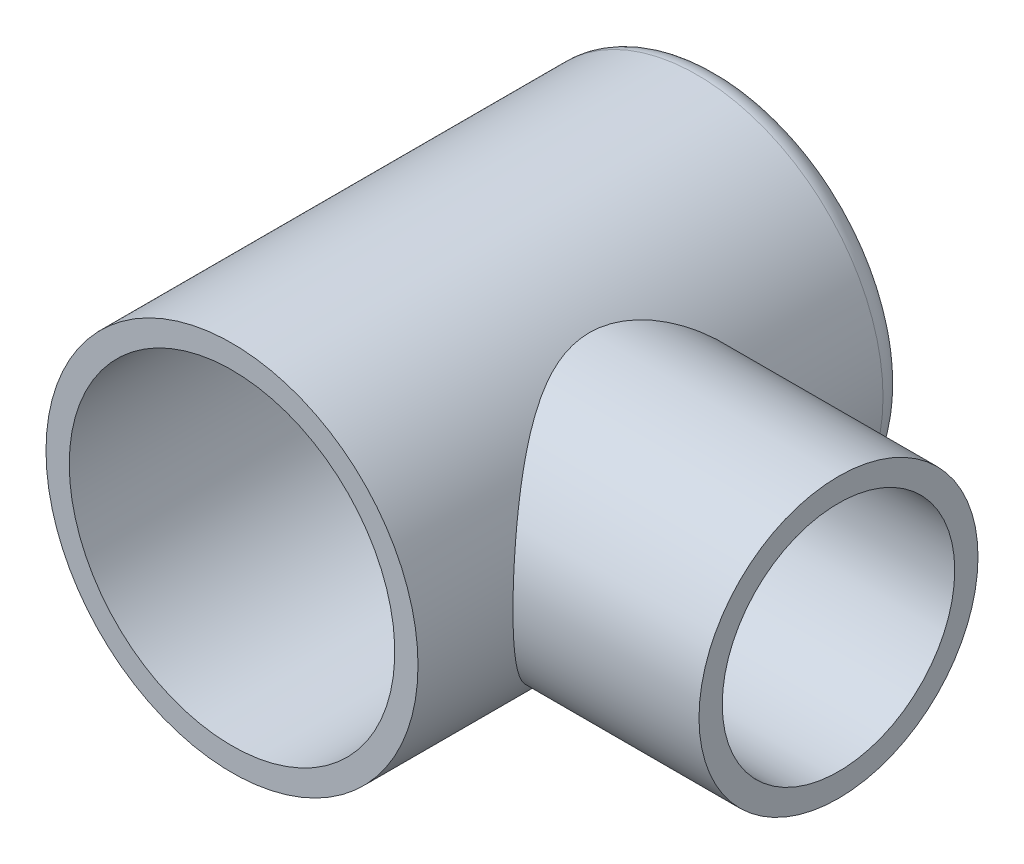
ISO-10303-21;
HEADER;
FILE_DESCRIPTION(('STEP AP214'),'2;1');
FILE_NAME('part.step','',(''),(''),'','','');
FILE_SCHEMA(('AUTOMOTIVE_DESIGN { 1 0 10303 214 1 1 1 1 }'));
ENDSEC;
DATA;
#1=APPLICATION_CONTEXT('core data for automotive mechanical design processes');
#2=APPLICATION_PROTOCOL_DEFINITION('international standard','automotive_design',2000,#1);
#3=PRODUCT_CONTEXT('',#1,'mechanical');
#4=PRODUCT('Part','Part','',(#3));
#5=PRODUCT_RELATED_PRODUCT_CATEGORY('part','',(#4));
#6=PRODUCT_DEFINITION_FORMATION('','',#4);
#7=PRODUCT_DEFINITION_CONTEXT('part definition',#1,'design');
#8=PRODUCT_DEFINITION('design','',#6,#7);
#9=PRODUCT_DEFINITION_SHAPE('','',#8);
#10=(LENGTH_UNIT() NAMED_UNIT(*) SI_UNIT(.MILLI.,.METRE.));
#11=(NAMED_UNIT(*) PLANE_ANGLE_UNIT() SI_UNIT($,.RADIAN.));
#12=(NAMED_UNIT(*) SI_UNIT($,.STERADIAN.) SOLID_ANGLE_UNIT());
#13=UNCERTAINTY_MEASURE_WITH_UNIT(LENGTH_MEASURE(1.E-05),#10,'distance_accuracy_value','');
#14=(GEOMETRIC_REPRESENTATION_CONTEXT(3) GLOBAL_UNCERTAINTY_ASSIGNED_CONTEXT((#13)) GLOBAL_UNIT_ASSIGNED_CONTEXT((#10,
#11,#12)) REPRESENTATION_CONTEXT('',''));
#15=CARTESIAN_POINT('',(0.,0.,0.));
#16=DIRECTION('',(0.,0.,1.));
#17=DIRECTION('',(1.,0.,0.));
#18=AXIS2_PLACEMENT_3D('',#15,#16,#17);
#19=CARTESIAN_POINT('',(0.,0.,7.99999999999996));
#20=DIRECTION('',(0.,0.,-0.999999999999997));
#21=DIRECTION('',(0.999999999999998,0.,0.));
#22=AXIS2_PLACEMENT_3D('',#19,#20,#21);
#23=PLANE('',#22);
#24=CARTESIAN_POINT('',(0.,0.,7.99999999999996));
#25=DIRECTION('',(0.,0.,0.999999999999997));
#26=DIRECTION('',(0.999999999999998,0.,0.));
#27=AXIS2_PLACEMENT_3D('',#24,#25,#26);
#28=CIRCLE('',#27,4.);
#29=CARTESIAN_POINT('',(3.99999999999999,0.,7.99999999999996));
#30=VERTEX_POINT('',#29);
#31=EDGE_CURVE('E72',#30,#30,#28,.T.);
#32=ORIENTED_EDGE('',*,*,#31,.T.);
#33=EDGE_LOOP('',(#32));
#34=FACE_BOUND('',#33,.T.);
#35=CARTESIAN_POINT('',(0.,0.,7.99999999999996));
#36=DIRECTION('',(0.,0.,0.999999999999997));
#37=DIRECTION('',(0.999999999999998,0.,0.));
#38=AXIS2_PLACEMENT_3D('',#35,#36,#37);
#39=CIRCLE('',#38,3.5);
#40=CARTESIAN_POINT('',(-3.49999999999999,0.,7.99999999999996));
#41=VERTEX_POINT('',#40);
#42=EDGE_CURVE('E110',#41,#41,#39,.T.);
#43=ORIENTED_EDGE('',*,*,#42,.F.);
#44=EDGE_LOOP('',(#43));
#45=FACE_BOUND('',#44,.T.);
#46=ADVANCED_FACE('F52',(#34,#45),#23,.F.);
#47=CARTESIAN_POINT('',(0.,0.,-1.99999999999999));
#48=DIRECTION('',(0.,0.,0.999999999999997));
#49=DIRECTION('',(-0.999999999999998,0.,0.));
#50=AXIS2_PLACEMENT_3D('',#47,#48,#49);
#51=CYLINDRICAL_SURFACE('',#50,4.);
#52=CARTESIAN_POINT('',(0.,0.,-1.99999999999999));
#53=DIRECTION('',(0.,0.,-0.999999999999997));
#54=DIRECTION('',(-0.999999999999998,0.,0.));
#55=AXIS2_PLACEMENT_3D('',#52,#53,#54);
#56=CIRCLE('',#55,4.);
#57=CARTESIAN_POINT('',(-3.99999999999999,0.,-1.99999999999999));
#58=VERTEX_POINT('',#57);
#59=EDGE_CURVE('E12',#58,#58,#56,.F.);
#60=ORIENTED_EDGE('',*,*,#59,.T.);
#61=EDGE_LOOP('',(#60));
#62=FACE_BOUND('',#61,.T.);
#63=CARTESIAN_POINT('',(4.,0.,-0.0425688714254572));
#64=CARTESIAN_POINT('',(3.99999929901188,0.0732613677680283,-0.0425681294064803));
#65=CARTESIAN_POINT('',(3.99798060344642,0.146542351053629,-0.0398783644385965));
#66=CARTESIAN_POINT('',(3.98996245699389,0.292508538993506,-0.0291740112904681));
#67=CARTESIAN_POINT('',(3.98396062416369,0.365193360793218,-0.0211562369206617));
#68=CARTESIAN_POINT('',(3.96012745087107,0.581731406983923,0.0107670346027781));
#69=CARTESIAN_POINT('',(3.93646888013437,0.723892660392384,0.0425420865656261));
#70=CARTESIAN_POINT('',(3.87591490407891,0.998506639011303,0.124856336149788));
#71=CARTESIAN_POINT('',(3.83910000314071,1.13101263465653,0.175281476957425));
#72=CARTESIAN_POINT('',(3.75501017021524,1.38483526994093,0.292516495506071));
#73=CARTESIAN_POINT('',(3.70773829853535,1.50615516858413,0.359321580158051));
#74=CARTESIAN_POINT('',(3.60099357013528,1.74693213195157,0.513954853795169));
#75=CARTESIAN_POINT('',(3.54079623314279,1.86517631030519,0.603156979847882));
#76=CARTESIAN_POINT('',(3.41533027981217,2.0860644994078,0.796431624417548));
#77=CARTESIAN_POINT('',(3.35005390635212,2.18868391091458,0.900527101022297));
#78=CARTESIAN_POINT('',(3.24492237261661,2.33993228026195,1.07796647267913));
#79=CARTESIAN_POINT('',(3.2052891581058,2.39379458304144,1.14706124098399));
#80=CARTESIAN_POINT('',(3.12676887933752,2.49548358548256,1.29002025939881));
#81=CARTESIAN_POINT('',(3.0878820430606,2.54330846513548,1.36388593762559));
#82=CARTESIAN_POINT('',(3.01210562553027,2.63261178619331,1.51620292345476));
#83=CARTESIAN_POINT('',(2.9752136814322,2.67409784691839,1.59464856653704));
#84=CARTESIAN_POINT('',(2.90479339731391,2.75043132677141,1.75613817612349));
#85=CARTESIAN_POINT('',(2.87126451310281,2.78527982077503,1.83918139528845));
#86=CARTESIAN_POINT('',(2.7995453278082,2.85760090658949,2.03639340399828));
#87=CARTESIAN_POINT('',(2.76315561923757,2.89251037008408,2.15220090250915));
#88=CARTESIAN_POINT('',(2.70343128888206,2.94841656316142,2.39022819170868));
#89=CARTESIAN_POINT('',(2.6800667983994,2.96944514417499,2.51243260291126));
#90=CARTESIAN_POINT('',(2.65007535494332,2.99625559824299,2.7617931530463));
#91=CARTESIAN_POINT('',(2.6436005765876,3.00189887157292,2.88898390185791));
#92=CARTESIAN_POINT('',(2.64919059245027,2.99696449042943,3.14266179080359));
#93=CARTESIAN_POINT('',(2.66126203341493,2.9863810204854,3.26914866236951));
#94=CARTESIAN_POINT('',(2.69935247502785,2.95195473462658,3.50381363263411));
#95=CARTESIAN_POINT('',(2.72374314386008,2.92964971367057,3.61250381871037));
#96=CARTESIAN_POINT('',(2.78228385423356,2.87411343637384,3.82430893802284));
#97=CARTESIAN_POINT('',(2.81644327194565,2.84087167817736,3.92741840118848));
#98=CARTESIAN_POINT('',(2.91483538729993,2.74066127604792,4.18994387426193));
#99=CARTESIAN_POINT('',(2.9845129831659,2.6656029678939,4.34423195445816));
#100=CARTESIAN_POINT('',(3.13066596252173,2.49236046828095,4.63582418373421));
#101=CARTESIAN_POINT('',(3.20715757761233,2.39412008565051,4.77308580909009));
#102=CARTESIAN_POINT('',(3.36103344637552,2.17303208149636,5.0329379073251));
#103=CARTESIAN_POINT('',(3.43839173465929,2.04962751039984,5.15507234180676));
#104=CARTESIAN_POINT('',(3.58496075956505,1.78084504353985,5.37795842266656));
#105=CARTESIAN_POINT('',(3.65418696517002,1.63551010852546,5.47875096910327));
#106=CARTESIAN_POINT('',(3.76559452155695,1.3558041609579,5.63739272700083));
#107=CARTESIAN_POINT('',(3.81041541916803,1.2250797406269,5.699800317149));
#108=CARTESIAN_POINT('',(3.88745808807126,0.952704346148676,5.80588088935944));
#109=CARTESIAN_POINT('',(3.91968774910058,0.811060281155401,5.84956560494769));
#110=CARTESIAN_POINT('',(3.96891177371227,0.519352465945107,5.91593785497662));
#111=CARTESIAN_POINT('',(3.98581186314606,0.369242566477487,5.93849548883176));
#112=CARTESIAN_POINT('',(4.00231766947939,0.0664024759297814,5.96053032093898));
#113=CARTESIAN_POINT('',(4.0019306830649,-0.0863265824213237,5.96001725708008));
#114=CARTESIAN_POINT('',(3.98485095596869,-0.373608422358571,5.93720939801986));
#115=CARTESIAN_POINT('',(3.96980177630783,-0.508444611327586,5.91711008323224));
#116=CARTESIAN_POINT('',(3.92702635972252,-0.772221384992236,5.8594835401177));
#117=CARTESIAN_POINT('',(3.89929742534594,-0.901160708783228,5.82195260341432));
#118=CARTESIAN_POINT('',(3.83199678428177,-1.15483339082488,5.72965617690301));
#119=CARTESIAN_POINT('',(3.79204165281684,-1.27925770587446,5.67432918102459));
#120=CARTESIAN_POINT('',(3.70333906113673,-1.51703769337244,5.54908580236102));
#121=CARTESIAN_POINT('',(3.65459038471486,-1.63039183139361,5.47916740127574));
#122=CARTESIAN_POINT('',(3.54238575945113,-1.86302046499997,5.31386644696053));
#123=CARTESIAN_POINT('',(3.47783324855999,-1.98012231440925,5.21618133379497));
#124=CARTESIAN_POINT('',(3.34476768394493,-2.19745073328884,5.0054063229399));
#125=CARTESIAN_POINT('',(3.27624605925973,-2.29763880438282,4.89228231391132));
#126=CARTESIAN_POINT('',(3.16783641864784,-2.44323760962617,4.70060129823206));
#127=CARTESIAN_POINT('',(3.12757855224153,-2.49441207840987,4.62657327036884));
#128=CARTESIAN_POINT('',(3.04868523124073,-2.59024776181559,4.47360440644699));
#129=CARTESIAN_POINT('',(3.01005037642924,-2.63490658340165,4.39466178048908));
#130=CARTESIAN_POINT('',(2.89884735629487,-2.75840992843588,4.15084826038665));
#131=CARTESIAN_POINT('',(2.83062934493712,-2.8272286655462,3.97840925241466));
#132=CARTESIAN_POINT('',(2.74237306217228,-2.91232161832907,3.68658489432916));
#133=CARTESIAN_POINT('',(2.71391502535151,-2.9386220669607,3.57264428808324));
#134=CARTESIAN_POINT('',(2.67084233048458,-2.97782857114492,3.34002161200894));
#135=CARTESIAN_POINT('',(2.65619677881272,-2.99076452454843,3.22135074520145));
#136=CARTESIAN_POINT('',(2.64315167964507,-3.00230698654587,2.98177193351367));
#137=CARTESIAN_POINT('',(2.64483460597191,-3.00084075038308,2.86085571412007));
#138=CARTESIAN_POINT('',(2.66432917886907,-2.98353723231362,2.62131697889622));
#139=CARTESIAN_POINT('',(2.68216163855031,-2.96768140541027,2.50269762475402));
#140=CARTESIAN_POINT('',(2.73634639677126,-2.91787829237152,2.24560555298943));
#141=CARTESIAN_POINT('',(2.77589185811732,-2.88073715900693,2.10845189393397));
#142=CARTESIAN_POINT('',(2.8676615343469,-2.78938673066517,1.84434626686756));
#143=CARTESIAN_POINT('',(2.91991769887725,-2.73513432117033,1.71742109666254));
#144=CARTESIAN_POINT('',(3.01293440174583,-2.6316132245464,1.51415864873975));
#145=CARTESIAN_POINT('',(3.05189072454864,-2.58648316812388,1.43481627227926));
#146=CARTESIAN_POINT('',(3.13140535919094,-2.48962257782423,1.28111640504182));
#147=CARTESIAN_POINT('',(3.17196358545146,-2.43789239621906,1.206758648541));
#148=CARTESIAN_POINT('',(3.25347248479455,-2.32800429973169,1.06307566786413));
#149=CARTESIAN_POINT('',(3.29442346245138,-2.26984095281447,0.993754779813766));
#150=CARTESIAN_POINT('',(3.3756032435117,-2.14725580217517,0.860410953708237));
#151=CARTESIAN_POINT('',(3.41583201121155,-2.08283369004462,0.796388277017199));
#152=CARTESIAN_POINT('',(3.49489651383713,-1.94728190281496,0.673457795497292));
#153=CARTESIAN_POINT('',(3.53371751668994,-1.87609990910415,0.61459804721401));
#154=CARTESIAN_POINT('',(3.60860502556332,-1.72767987087953,0.503101371511844));
#155=CARTESIAN_POINT('',(3.64467210969302,-1.65044310433565,0.450463136779797));
#156=CARTESIAN_POINT('',(3.71302541445825,-1.49030317410492,0.352089186519774));
#157=CARTESIAN_POINT('',(3.74531815238001,-1.40741018139534,0.306341532142554));
#158=CARTESIAN_POINT('',(3.8052164046783,-1.23634243548294,0.222374412531198));
#159=CARTESIAN_POINT('',(3.8328243370667,-1.14817043896907,0.184151062068023));
#160=CARTESIAN_POINT('',(3.89270294176924,-0.929739140257544,0.101868429607504));
#161=CARTESIAN_POINT('',(3.92219862865417,-0.797123031202015,0.0619067657569259));
#162=CARTESIAN_POINT('',(3.96768259876897,-0.525667463530594,0.000586248985263055));
#163=CARTESIAN_POINT('',(3.9837086019408,-0.386846538130216,-0.0208245582138599));
#164=CARTESIAN_POINT('',(3.994909382017,-0.205928000583096,-0.0357781700489366));
#165=CARTESIAN_POINT('',(3.99681576437034,-0.164816108820159,-0.0383219742464231));
#166=CARTESIAN_POINT('',(3.99936137264783,-0.0824715620593046,-0.0417176699571443));
#167=CARTESIAN_POINT('',(4.00000039458683,-0.0412388886906539,-0.0425692891085953));
#168=CARTESIAN_POINT('',(4.,0.,-0.0425688714254572));
#169=B_SPLINE_CURVE_WITH_KNOTS('',3,(#63,#64,#65,#66,#67,#68,#69,#70,#71,#72,#73,#74,#75,#76,
#77,#78,#79,#80,#81,#82,#83,#84,#85,#86,#87,#88,#89,#90,#91,#92,#93,#94,#95,#96,#97,#98,#99,
#100,#101,#102,#103,#104,#105,#106,#107,#108,#109,#110,#111,#112,#113,#114,#115,#116,#117,#118,
#119,#120,#121,#122,#123,#124,#125,#126,#127,#128,#129,#130,#131,#132,#133,#134,#135,#136,#137,
#138,#139,#140,#141,#142,#143,#144,#145,#146,#147,#148,#149,#150,#151,#152,#153,#154,#155,#156,
#157,#158,#159,#160,#161,#162,#163,#164,#165,#166,#167,#168),.UNSPECIFIED.,.T.,.F.,(4,2,2,2,2,2,
2,2,2,2,2,2,2,2,2,2,2,2,2,2,2,2,2,2,2,2,2,2,2,2,2,2,2,2,2,2,2,2,2,2,2,2,2,2,2,2,2,2,2,2,2,2,4),
(0.,0.2197335241914,0.439598569068992,0.879847634771396,1.31744766307167,1.7549197936235,
2.2329036222735,2.71163236402816,2.99983518527189,3.28812468015057,3.57606487508902,
3.86395840178997,4.24151729125786,4.61820678456563,4.99827867308497,5.37848680666402,
5.718064723914,6.05796967267261,6.61051355677802,7.1644107678176,7.73224459942163,
8.29898017053364,8.75205702078761,9.20484951352217,9.6604080839978,10.1157743699921,
10.5253506608997,10.9350141243761,11.3591357103334,11.7833160002106,12.2783345622972,
12.7744651003689,13.0698938265096,13.3654307846348,13.9540907813181,14.3138420927746,
14.6727868466002,15.033545541411,15.3947698355934,15.8348522835191,16.2760525671149,
16.5734564783342,16.8708445226935,17.1684856206864,17.466141392762,17.7663250552984,
18.0664455283281,18.3660398682404,18.6654791022958,19.0884486476651,19.5102297424976,
19.6338980344064,19.7575862294511),.UNSPECIFIED.);
#170=CARTESIAN_POINT('',(4.,0.,-0.0425688714254572));
#171=VERTEX_POINT('',#170);
#172=EDGE_CURVE('E103',#171,#171,#169,.T.);
#173=ORIENTED_EDGE('',*,*,#172,.F.);
#174=EDGE_LOOP('',(#173));
#175=FACE_BOUND('',#174,.T.);
#176=ORIENTED_EDGE('',*,*,#31,.F.);
#177=EDGE_LOOP('',(#176));
#178=FACE_BOUND('',#177,.T.);
#179=ADVANCED_FACE('F80',(#62,#175,#178),#51,.T.);
#180=CARTESIAN_POINT('',(0.,0.,-1.99999999999999));
#181=DIRECTION('',(0.,0.,0.999999999999997));
#182=DIRECTION('',(-0.999999999999998,0.,0.));
#183=AXIS2_PLACEMENT_3D('',#180,#181,#182);
#184=CYLINDRICAL_SURFACE('',#183,3.5);
#185=CARTESIAN_POINT('',(0.,0.,-1.99999999999999));
#186=DIRECTION('',(0.,0.,0.999999999999997));
#187=DIRECTION('',(0.999999999999998,0.,0.));
#188=AXIS2_PLACEMENT_3D('',#185,#186,#187);
#189=CIRCLE('',#188,3.5);
#190=CARTESIAN_POINT('',(-3.49999999999999,0.,-1.99999999999999));
#191=VERTEX_POINT('',#190);
#192=EDGE_CURVE('E119',#191,#191,#189,.T.);
#193=CARTESIAN_POINT('',(-3.49999999999999,0.,-1.99999999999999));
#194=CARTESIAN_POINT('',(-3.49999999999999,0.,-1.89583333333333));
#195=CARTESIAN_POINT('',(-3.49999999999999,0.,-1.79166666666666));
#196=CARTESIAN_POINT('',(-3.49999999999999,0.,-1.58333333333333));
#197=CARTESIAN_POINT('',(-3.49999999999999,0.,-1.47916666666666));
#198=CARTESIAN_POINT('',(-3.49999999999999,0.,-1.27083333333333));
#199=CARTESIAN_POINT('',(-3.49999999999999,0.,-1.16666666666666));
#200=CARTESIAN_POINT('',(-3.49999999999999,0.,-0.95833333333333));
#201=CARTESIAN_POINT('',(-3.49999999999999,0.,-0.854166666666664));
#202=CARTESIAN_POINT('',(-3.49999999999999,0.,-0.645833333333332));
#203=CARTESIAN_POINT('',(-3.49999999999999,0.,-0.541666666666666));
#204=CARTESIAN_POINT('',(-3.49999999999999,0.,-0.333333333333334));
#205=CARTESIAN_POINT('',(-3.49999999999999,0.,-0.229166666666667));
#206=CARTESIAN_POINT('',(-3.49999999999999,0.,-0.0208333333333354));
#207=CARTESIAN_POINT('',(-3.49999999999999,0.,0.0833333333333307));
#208=CARTESIAN_POINT('',(-3.49999999999999,0.,0.291666666666663));
#209=CARTESIAN_POINT('',(-3.49999999999999,0.,0.395833333333329));
#210=CARTESIAN_POINT('',(-3.49999999999999,0.,0.604166666666661));
#211=CARTESIAN_POINT('',(-3.49999999999999,0.,0.708333333333328));
#212=CARTESIAN_POINT('',(-3.49999999999999,0.,0.91666666666666));
#213=CARTESIAN_POINT('',(-3.49999999999999,0.,1.02083333333333));
#214=CARTESIAN_POINT('',(-3.49999999999999,0.,1.22916666666666));
#215=CARTESIAN_POINT('',(-3.49999999999999,0.,1.33333333333332));
#216=CARTESIAN_POINT('',(-3.49999999999999,0.,1.54166666666666));
#217=CARTESIAN_POINT('',(-3.49999999999999,0.,1.64583333333332));
#218=CARTESIAN_POINT('',(-3.49999999999999,0.,1.85416666666665));
#219=CARTESIAN_POINT('',(-3.49999999999999,0.,1.95833333333332));
#220=CARTESIAN_POINT('',(-3.49999999999999,0.,2.16666666666665));
#221=CARTESIAN_POINT('',(-3.49999999999999,0.,2.27083333333332));
#222=CARTESIAN_POINT('',(-3.49999999999999,0.,2.47916666666665));
#223=CARTESIAN_POINT('',(-3.49999999999999,0.,2.58333333333332));
#224=CARTESIAN_POINT('',(-3.49999999999999,0.,2.79166666666665));
#225=CARTESIAN_POINT('',(-3.49999999999999,0.,2.89583333333332));
#226=CARTESIAN_POINT('',(-3.49999999999999,0.,3.10416666666665));
#227=CARTESIAN_POINT('',(-3.49999999999999,0.,3.20833333333332));
#228=CARTESIAN_POINT('',(-3.49999999999999,0.,3.41666666666665));
#229=CARTESIAN_POINT('',(-3.49999999999999,0.,3.52083333333331));
#230=CARTESIAN_POINT('',(-3.49999999999999,0.,3.72916666666665));
#231=CARTESIAN_POINT('',(-3.49999999999999,0.,3.83333333333331));
#232=CARTESIAN_POINT('',(-3.49999999999999,0.,4.04166666666664));
#233=CARTESIAN_POINT('',(-3.49999999999999,0.,4.14583333333331));
#234=CARTESIAN_POINT('',(-3.49999999999999,0.,4.35416666666664));
#235=CARTESIAN_POINT('',(-3.49999999999999,0.,4.45833333333331));
#236=CARTESIAN_POINT('',(-3.49999999999999,0.,4.66666666666664));
#237=CARTESIAN_POINT('',(-3.49999999999999,0.,4.77083333333331));
#238=CARTESIAN_POINT('',(-3.49999999999999,0.,4.97916666666664));
#239=CARTESIAN_POINT('',(-3.49999999999999,0.,5.0833333333333));
#240=CARTESIAN_POINT('',(-3.49999999999999,0.,5.29166666666664));
#241=CARTESIAN_POINT('',(-3.49999999999999,0.,5.3958333333333));
#242=CARTESIAN_POINT('',(-3.49999999999999,0.,5.60416666666664));
#243=CARTESIAN_POINT('',(-3.49999999999999,0.,5.7083333333333));
#244=CARTESIAN_POINT('',(-3.49999999999999,0.,5.91666666666663));
#245=CARTESIAN_POINT('',(-3.49999999999999,0.,6.0208333333333));
#246=CARTESIAN_POINT('',(-3.49999999999999,0.,6.22916666666663));
#247=CARTESIAN_POINT('',(-3.49999999999999,0.,6.3333333333333));
#248=CARTESIAN_POINT('',(-3.49999999999999,0.,6.54166666666663));
#249=CARTESIAN_POINT('',(-3.49999999999999,0.,6.6458333333333));
#250=CARTESIAN_POINT('',(-3.49999999999999,0.,6.85416666666663));
#251=CARTESIAN_POINT('',(-3.49999999999999,0.,6.95833333333329));
#252=CARTESIAN_POINT('',(-3.49999999999999,0.,7.16666666666663));
#253=CARTESIAN_POINT('',(-3.49999999999999,0.,7.27083333333329));
#254=CARTESIAN_POINT('',(-3.49999999999999,0.,7.47916666666663));
#255=CARTESIAN_POINT('',(-3.49999999999999,0.,7.58333333333329));
#256=CARTESIAN_POINT('',(-3.49999999999999,0.,7.79166666666662));
#257=CARTESIAN_POINT('',(-3.49999999999999,0.,7.89583333333329));
#258=CARTESIAN_POINT('',(-3.49999999999999,0.,7.99999999999996));
#259=B_SPLINE_CURVE_WITH_KNOTS('',3,(#193,#194,#195,#196,#197,#198,#199,#200,#201,#202,#203,
#204,#205,#206,#207,#208,#209,#210,#211,#212,#213,#214,#215,#216,#217,#218,#219,#220,#221,#222,
#223,#224,#225,#226,#227,#228,#229,#230,#231,#232,#233,#234,#235,#236,#237,#238,#239,#240,#241,
#242,#243,#244,#245,#246,#247,#248,#249,#250,#251,#252,#253,#254,#255,#256,#257,#258),
.UNSPECIFIED.,.F.,.F.,(4,2,2,2,2,2,2,2,2,2,2,2,2,2,2,2,2,2,2,2,2,2,2,2,2,2,2,2,2,2,2,2,4),(0.,
0.312499999999999,0.624999999999997,0.937499999999995,1.24999999999999,1.56249999999999,
1.87499999999999,2.18749999999999,2.49999999999999,2.81249999999999,3.12499999999998,
3.43749999999998,3.74999999999998,4.06249999999998,4.37499999999998,4.68749999999998,
4.99999999999997,5.31249999999997,5.62499999999997,5.93749999999997,6.24999999999997,
6.56249999999997,6.87499999999996,7.18749999999996,7.49999999999996,7.81249999999996,
8.12499999999996,8.43749999999996,8.74999999999995,9.06249999999995,9.37499999999995,
9.68749999999995,9.99999999999995),.UNSPECIFIED.);
#260=EDGE_CURVE('BSEAM100',#191,#41,#259,.T.);
#261=ORIENTED_EDGE('',*,*,#192,.F.);
#262=ORIENTED_EDGE('',*,*,#42,.T.);
#263=ORIENTED_EDGE('',*,*,#260,.T.);
#264=ORIENTED_EDGE('',*,*,#260,.F.);
#265=EDGE_LOOP('',(#261,#263,#262,#264));
#266=FACE_BOUND('',#265,.T.);
#267=ADVANCED_FACE('F100',(#266),#184,.F.);
#268=CARTESIAN_POINT('',(-4.001,0.,2.95743112857453));
#269=DIRECTION('',(0.999999999999998,0.,0.));
#270=DIRECTION('',(0.,0.,-0.999999999999997));
#271=AXIS2_PLACEMENT_3D('',#268,#269,#270);
#272=CYLINDRICAL_SURFACE('',#271,3.);
#273=CARTESIAN_POINT('',(8.,0.,2.95743112857453));
#274=DIRECTION('',(0.999999999999998,0.,0.));
#275=DIRECTION('',(0.,0.,-0.999999999999997));
#276=AXIS2_PLACEMENT_3D('',#273,#274,#275);
#277=CIRCLE('',#276,3.);
#278=CARTESIAN_POINT('',(8.,0.,-0.0425688714254598));
#279=VERTEX_POINT('',#278);
#280=EDGE_CURVE('E111',#279,#279,#277,.T.);
#281=ORIENTED_EDGE('',*,*,#280,.F.);
#282=EDGE_LOOP('',(#281));
#283=FACE_BOUND('',#282,.T.);
#284=ORIENTED_EDGE('',*,*,#172,.T.);
#285=EDGE_LOOP('',(#284));
#286=FACE_BOUND('',#285,.T.);
#287=ADVANCED_FACE('F95',(#283,#286),#272,.T.);
#288=CARTESIAN_POINT('',(8.,0.,2.95743112857453));
#289=DIRECTION('',(0.999999999999998,0.,0.));
#290=DIRECTION('',(0.,0.,-0.999999999999997));
#291=AXIS2_PLACEMENT_3D('',#288,#289,#290);
#292=PLANE('',#291);
#293=CARTESIAN_POINT('',(8.,0.,2.95743112857453));
#294=DIRECTION('',(0.999999999999998,0.,0.));
#295=DIRECTION('',(0.,0.,-0.999999999999997));
#296=AXIS2_PLACEMENT_3D('',#293,#294,#295);
#297=CIRCLE('',#296,2.5);
#298=CARTESIAN_POINT('',(8.,0.,0.457431128574539));
#299=VERTEX_POINT('',#298);
#300=EDGE_CURVE('E112',#299,#299,#297,.T.);
#301=ORIENTED_EDGE('',*,*,#300,.F.);
#302=EDGE_LOOP('',(#301));
#303=FACE_BOUND('',#302,.T.);
#304=ORIENTED_EDGE('',*,*,#280,.T.);
#305=EDGE_LOOP('',(#304));
#306=FACE_BOUND('',#305,.T.);
#307=ADVANCED_FACE('F89',(#303,#306),#292,.T.);
#308=CARTESIAN_POINT('',(-4.001,0.,2.95743112857453));
#309=DIRECTION('',(0.999999999999998,0.,0.));
#310=DIRECTION('',(0.,0.,-0.999999999999997));
#311=AXIS2_PLACEMENT_3D('',#308,#309,#310);
#312=CYLINDRICAL_SURFACE('',#311,2.5);
#313=ORIENTED_EDGE('',*,*,#300,.T.);
#314=EDGE_LOOP('',(#313));
#315=FACE_BOUND('',#314,.T.);
#316=CARTESIAN_POINT('',(4.,0.,0.457431128574543));
#317=CARTESIAN_POINT('',(3.99999041333571,-0.127017476559872,0.457441604718162));
#318=CARTESIAN_POINT('',(3.9938860659399,-0.254191951791705,0.467177628476215));
#319=CARTESIAN_POINT('',(3.97004375552586,-0.504637456621345,0.505602258258803));
#320=CARTESIAN_POINT('',(3.95228361873137,-0.627900575825984,0.534326988835747));
#321=CARTESIAN_POINT('',(3.90691695293563,-0.866410868269162,0.609053981862085));
#322=CARTESIAN_POINT('',(3.87935918690877,-0.981694420709433,0.654970738362102));
#323=CARTESIAN_POINT('',(3.81669199838277,-1.20252080434995,0.762202796066005));
#324=CARTESIAN_POINT('',(3.7815834126609,-1.30806471304098,0.823516391127662));
#325=CARTESIAN_POINT('',(3.70340304945466,-1.51594836437078,0.965204285165639));
#326=CARTESIAN_POINT('',(3.65991924217889,-1.61735911616791,1.04670973127629));
#327=CARTESIAN_POINT('',(3.57062700058921,-1.80597275567284,1.22386947483305));
#328=CARTESIAN_POINT('',(3.52481549782957,-1.89315621594405,1.31954278431347));
#329=CARTESIAN_POINT('',(3.42860837235627,-2.06285746302521,1.53749891786574));
#330=CARTESIAN_POINT('',(3.37843221966147,-2.14314412018318,1.66163070200548));
#331=CARTESIAN_POINT('',(3.28660396278104,-2.28147932079995,1.92456075925288));
#332=CARTESIAN_POINT('',(3.2449375200046,-2.33956541787438,2.06333375374251));
#333=CARTESIAN_POINT('',(3.18619151248814,-2.41866801180576,2.31505217612025));
#334=CARTESIAN_POINT('',(3.16553811970885,-2.44539104794679,2.42536476549285));
#335=CARTESIAN_POINT('',(3.1356271466086,-2.48363687119141,2.65004297995522));
#336=CARTESIAN_POINT('',(3.12635347378456,-2.49518112485638,2.76440264574774));
#337=CARTESIAN_POINT('',(3.12059771534501,-2.50237836690497,2.9942571614509));
#338=CARTESIAN_POINT('',(3.12414917427958,-2.49798968200885,3.10975419915249));
#339=CARTESIAN_POINT('',(3.14354804883411,-2.47352633347829,3.33805133730117));
#340=CARTESIAN_POINT('',(3.15940531965489,-2.45343909745149,3.45084920142446));
#341=CARTESIAN_POINT('',(3.20065145822146,-2.3993620946426,3.66830802531813));
#342=CARTESIAN_POINT('',(3.22581428653571,-2.36570043522604,3.7730960082919));
#343=CARTESIAN_POINT('',(3.28291134443418,-2.28580369589507,3.97575352504774));
#344=CARTESIAN_POINT('',(3.31484796808522,-2.23956416894039,4.07362059641798));
#345=CARTESIAN_POINT('',(3.38909625095658,-2.12589830407261,4.27909753608469));
#346=CARTESIAN_POINT('',(3.4322315520855,-2.05612773657747,4.38511218042691));
#347=CARTESIAN_POINT('',(3.52011451554715,-1.90176111958638,4.58509225555093));
#348=CARTESIAN_POINT('',(3.56486379714022,-1.81714983251341,4.67904512861966));
#349=CARTESIAN_POINT('',(3.65959667460597,-1.61904732877734,4.86803213815713));
#350=CARTESIAN_POINT('',(3.70922571443728,-1.50309447420017,4.96068707129613));
#351=CARTESIAN_POINT('',(3.8005660184067,-1.25426444468515,5.12514292220555));
#352=CARTESIAN_POINT('',(3.84228039228673,-1.12139395127005,5.196952036384));
#353=CARTESIAN_POINT('',(3.89435975869902,-0.915775751567441,5.28477708520951));
#354=CARTESIAN_POINT('',(3.90966874385268,-0.848193583187393,5.31026541500492));
#355=CARTESIAN_POINT('',(3.93701839875445,-0.710492049478447,5.35543877905318));
#356=CARTESIAN_POINT('',(3.94906095588034,-0.640374175967901,5.37512716514535));
#357=CARTESIAN_POINT('',(3.96949699527849,-0.498239019538474,5.40836529021692));
#358=CARTESIAN_POINT('',(3.97789374843884,-0.426223500915277,5.42192053210053));
#359=CARTESIAN_POINT('',(3.99078766491331,-0.280965673560733,5.4426774218881));
#360=CARTESIAN_POINT('',(3.99528549435853,-0.207723576570752,5.44988015512183));
#361=CARTESIAN_POINT('',(4.00193773474167,-0.00911917689680434,5.46054043321806));
#362=CARTESIAN_POINT('',(4.000238122366,0.116782016705697,5.45783149169805));
#363=CARTESIAN_POINT('',(3.98518313408306,0.365967766011667,5.43367146410909));
#364=CARTESIAN_POINT('',(3.97182855210102,0.489252499359948,5.4122216546498));
#365=CARTESIAN_POINT('',(3.93547975555369,0.725036194002602,5.35295254059174));
#366=CARTESIAN_POINT('',(3.91288306371127,0.837768421062916,5.31580640780474));
#367=CARTESIAN_POINT('',(3.85991402897874,1.05527816125332,5.2268387572621));
#368=CARTESIAN_POINT('',(3.82954038411641,1.16005433861599,5.17501478207309));
#369=CARTESIAN_POINT('',(3.75980014020657,1.37016761969194,5.05240059106669));
#370=CARTESIAN_POINT('',(3.71983526755372,1.47449380296905,4.9802239562995));
#371=CARTESIAN_POINT('',(3.63613942885727,1.67028541330074,4.82184343210524));
#372=CARTESIAN_POINT('',(3.59240430473134,1.76173634038025,4.73562395968883));
#373=CARTESIAN_POINT('',(3.49811738486729,1.94294835276253,4.53716103872887));
#374=CARTESIAN_POINT('',(3.44749766579191,2.03053702733638,4.422956713077));
#375=CARTESIAN_POINT('',(3.35133525746892,2.1856070491644,4.17967956159195));
#376=CARTESIAN_POINT('',(3.30578906708369,2.25310231693768,4.05061711568321));
#377=CARTESIAN_POINT('',(3.23467060578839,2.35369543821018,3.80804683197495));
#378=CARTESIAN_POINT('',(3.20691272363805,2.39103791720685,3.69694962718582));
#379=CARTESIAN_POINT('',(3.16210061351252,2.45000216420748,3.46864483696108));
#380=CARTESIAN_POINT('',(3.1450296652982,2.47164849805251,3.3514471088851));
#381=CARTESIAN_POINT('',(3.124126499326,2.49802767469226,3.11325057560414));
#382=CARTESIAN_POINT('',(3.12037003193165,2.50266374586469,2.9922339606946));
#383=CARTESIAN_POINT('',(3.12698126375719,2.49439556773531,2.75116920474502));
#384=CARTESIAN_POINT('',(3.13735365770479,2.48148548821457,2.63112139895518));
#385=CARTESIAN_POINT('',(3.16910777009989,2.44076547086104,2.40537154913843));
#386=CARTESIAN_POINT('',(3.18953614189074,2.41423847191721,2.29929256407216));
#387=CARTESIAN_POINT('',(3.23835062785226,2.34835238743426,2.09316097105628));
#388=CARTESIAN_POINT('',(3.26674005971309,2.3089879509078,1.99311089675726));
#389=CARTESIAN_POINT('',(3.33327797617852,2.21205415803959,1.7862378042364));
#390=CARTESIAN_POINT('',(3.3722442852408,2.15267427981667,1.6805311823108));
#391=CARTESIAN_POINT('',(3.45335445323995,2.01999894889208,1.47955374286528));
#392=CARTESIAN_POINT('',(3.49550086438999,1.94669224594686,1.38429146120046));
#393=CARTESIAN_POINT('',(3.58803675426846,1.77134669685941,1.18740554477611));
#394=CARTESIAN_POINT('',(3.63840488260278,1.66649284489893,1.08826136703525));
#395=CARTESIAN_POINT('',(3.7339805383823,1.43961937990849,0.908429532449483));
#396=CARTESIAN_POINT('',(3.77918486147258,1.3175892119665,0.827753304897031));
#397=CARTESIAN_POINT('',(3.83959214728415,1.12346357942551,0.722867690015787));
#398=CARTESIAN_POINT('',(3.85851834157057,1.05679601158095,0.690556328527547));
#399=CARTESIAN_POINT('',(3.89335165397882,0.920199584374068,0.631758876750741));
#400=CARTESIAN_POINT('',(3.9092605122592,0.850272633931989,0.605269427439438));
#401=CARTESIAN_POINT('',(3.93753374175517,0.707873688437771,0.558573984112369));
#402=CARTESIAN_POINT('',(3.94990764965183,0.635409144572269,0.53835107132887));
#403=CARTESIAN_POINT('',(3.97075677458059,0.488456989557118,0.504455672992165));
#404=CARTESIAN_POINT('',(3.97923486692924,0.413970913545529,0.490778356135068));
#405=CARTESIAN_POINT('',(3.99038271291772,0.28285260509405,0.472840718347811));
#406=CARTESIAN_POINT('',(3.99398159517595,0.226501515914869,0.467069598322355));
#407=CARTESIAN_POINT('',(3.99879245372932,0.113444074519047,0.459362344947383));
#408=CARTESIAN_POINT('',(4.00000428228699,0.0567377005313056,0.457426448964182));
#409=CARTESIAN_POINT('',(4.,0.,0.457431128574543));
#410=B_SPLINE_CURVE_WITH_KNOTS('',3,(#316,#317,#318,#319,#320,#321,#322,#323,#324,#325,#326,
#327,#328,#329,#330,#331,#332,#333,#334,#335,#336,#337,#338,#339,#340,#341,#342,#343,#344,#345,
#346,#347,#348,#349,#350,#351,#352,#353,#354,#355,#356,#357,#358,#359,#360,#361,#362,#363,#364,
#365,#366,#367,#368,#369,#370,#371,#372,#373,#374,#375,#376,#377,#378,#379,#380,#381,#382,#383,
#384,#385,#386,#387,#388,#389,#390,#391,#392,#393,#394,#395,#396,#397,#398,#399,#400,#401,#402,
#403,#404,#405,#406,#407,#408,#409),.UNSPECIFIED.,.T.,.F.,(4,2,2,2,2,2,2,2,2,2,2,2,2,2,2,2,2,2,
2,2,2,2,2,2,2,2,2,2,2,2,2,2,2,2,2,2,2,2,2,2,2,2,2,2,2,2,4),(0.,0.380824602868266,
0.762375788256925,1.14205397519027,1.52169010807759,1.93164374107244,2.34215256651403,
2.80825951705947,3.27357449214021,3.61824017759434,3.96241789414781,4.30749646997556,
4.65285169010166,4.99031678920873,5.32790135816065,5.72854900708719,6.12961045150363,
6.59684361399043,7.06389281455722,7.28510978359955,7.50619865744382,7.72708876613707,
7.94794112831293,8.32363778110177,8.69930884379593,9.06028425977629,9.42132014771965,
9.81879878896137,10.216721545704,10.6724083464246,11.1277787130885,11.4876929754247,
11.8470427174174,12.2084336629143,12.5699447204276,12.9023575499051,13.2349091154191,
13.6156046298899,13.9966089922257,14.4531049498525,14.9098826607203,15.138984863948,
15.3679545348469,15.5963005225022,15.8244777070605,15.994578512822,16.1646898459841),.UNSPECIFIED.);
#411=CARTESIAN_POINT('',(4.,0.,0.457431128574543));
#412=VERTEX_POINT('',#411);
#413=EDGE_CURVE('E66',#412,#412,#410,.T.);
#414=ORIENTED_EDGE('',*,*,#413,.T.);
#415=EDGE_LOOP('',(#414));
#416=FACE_BOUND('',#415,.T.);
#417=ADVANCED_FACE('F83',(#315,#416),#312,.F.);
#418=ORIENTED_EDGE('',*,*,#413,.F.);
#419=EDGE_LOOP('',(#418));
#420=FACE_BOUND('',#419,.T.);
#421=ADVANCED_FACE('F88',(#420),#51,.T.);
#422=CARTESIAN_POINT('',(0.,0.,-1.99999999999999));
#423=DIRECTION('',(0.,0.,-0.999999999999997));
#424=DIRECTION('',(-0.999999999999998,0.,0.));
#425=AXIS2_PLACEMENT_3D('',#422,#423,#424);
#426=PLANE('',#425);
#427=ORIENTED_EDGE('',*,*,#192,.T.);
#428=EDGE_LOOP('',(#427));
#429=FACE_BOUND('',#428,.T.);
#430=ADVANCED_FACE('F146',(#429),#426,.F.);
#431=CARTESIAN_POINT('',(0.,0.,-2.49999999999998));
#432=DIRECTION('',(0.,0.,-0.999999999999997));
#433=DIRECTION('',(-0.999999999999998,0.,0.));
#434=AXIS2_PLACEMENT_3D('',#431,#432,#433);
#435=PLANE('',#434);
#436=CARTESIAN_POINT('',(0.,0.,-2.49999999999998));
#437=DIRECTION('',(0.,0.,-0.999999999999997));
#438=DIRECTION('',(-0.999999999999998,0.,0.));
#439=AXIS2_PLACEMENT_3D('',#436,#437,#438);
#440=CIRCLE('',#439,3.5);
#441=CARTESIAN_POINT('',(-3.49999999999999,0.,-2.49999999999998));
#442=VERTEX_POINT('',#441);
#443=EDGE_CURVE('E60',#442,#442,#440,.T.);
#444=ORIENTED_EDGE('',*,*,#443,.T.);
#445=EDGE_LOOP('',(#444));
#446=FACE_BOUND('',#445,.T.);
#447=ADVANCED_FACE('F151',(#446),#435,.T.);
#448=CARTESIAN_POINT('',(0.,0.,-1.99999999999999));
#449=DIRECTION('',(0.,0.,-0.999999999999997));
#450=DIRECTION('',(-0.999999999999998,0.,0.));
#451=AXIS2_PLACEMENT_3D('',#448,#449,#450);
#452=TOROIDAL_SURFACE('',#451,3.5,0.5);
#453=ORIENTED_EDGE('',*,*,#59,.F.);
#454=EDGE_LOOP('',(#453));
#455=FACE_BOUND('',#454,.T.);
#456=ORIENTED_EDGE('',*,*,#443,.F.);
#457=EDGE_LOOP('',(#456));
#458=FACE_BOUND('',#457,.T.);
#459=ADVANCED_FACE('F54',(#455,#458),#452,.T.);
#460=CLOSED_SHELL('',(#46,#179,#267,#287,#307,#417,#421,#430,#447,#459));
#461=MANIFOLD_SOLID_BREP('B2',#460);
#462=ADVANCED_BREP_SHAPE_REPRESENTATION('',(#18,#461),#14);
#463=SHAPE_DEFINITION_REPRESENTATION(#9,#462);
ENDSEC;
END-ISO-10303-21;
